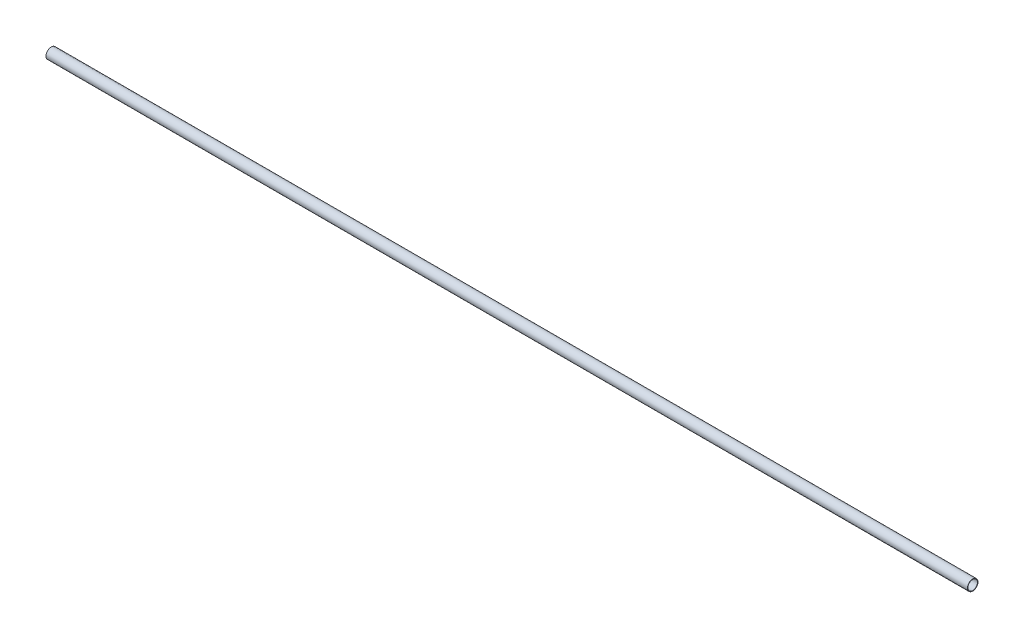
ISO-10303-21;
HEADER;
FILE_DESCRIPTION(('STEP AP214'),'2;1');
FILE_NAME('part.step','',(''),(''),'','','');
FILE_SCHEMA(('AUTOMOTIVE_DESIGN { 1 0 10303 214 1 1 1 1 }'));
ENDSEC;
DATA;
#1=APPLICATION_CONTEXT('core data for automotive mechanical design processes');
#2=APPLICATION_PROTOCOL_DEFINITION('international standard','automotive_design',2000,#1);
#3=PRODUCT_CONTEXT('',#1,'mechanical');
#4=PRODUCT('Part','Part','',(#3));
#5=PRODUCT_RELATED_PRODUCT_CATEGORY('part','',(#4));
#6=PRODUCT_DEFINITION_FORMATION('','',#4);
#7=PRODUCT_DEFINITION_CONTEXT('part definition',#1,'design');
#8=PRODUCT_DEFINITION('design','',#6,#7);
#9=PRODUCT_DEFINITION_SHAPE('','',#8);
#10=(LENGTH_UNIT() NAMED_UNIT(*) SI_UNIT(.MILLI.,.METRE.));
#11=(NAMED_UNIT(*) PLANE_ANGLE_UNIT() SI_UNIT($,.RADIAN.));
#12=(NAMED_UNIT(*) SI_UNIT($,.STERADIAN.) SOLID_ANGLE_UNIT());
#13=UNCERTAINTY_MEASURE_WITH_UNIT(LENGTH_MEASURE(1.E-05),#10,'distance_accuracy_value','');
#14=(GEOMETRIC_REPRESENTATION_CONTEXT(3) GLOBAL_UNCERTAINTY_ASSIGNED_CONTEXT((#13)) GLOBAL_UNIT_ASSIGNED_CONTEXT((#10,
#11,#12)) REPRESENTATION_CONTEXT('',''));
#15=CARTESIAN_POINT('',(0.,0.,0.));
#16=DIRECTION('',(0.,0.,1.));
#17=DIRECTION('',(1.,0.,0.));
#18=AXIS2_PLACEMENT_3D('',#15,#16,#17);
#19=CARTESIAN_POINT('',(1219.2,0.,0.));
#20=DIRECTION('',(-1.,0.,0.));
#21=DIRECTION('',(0.,0.,1.));
#22=AXIS2_PLACEMENT_3D('',#19,#20,#21);
#23=CYLINDRICAL_SURFACE('',#22,6.985);
#24=CARTESIAN_POINT('',(1219.2,0.,0.));
#25=DIRECTION('',(1.,0.,0.));
#26=DIRECTION('',(0.,0.,-1.));
#27=AXIS2_PLACEMENT_3D('',#24,#25,#26);
#28=CIRCLE('',#27,6.985);
#29=CARTESIAN_POINT('',(1219.2,0.,-6.985));
#30=VERTEX_POINT('',#29);
#31=EDGE_CURVE('E10',#30,#30,#28,.T.);
#32=ORIENTED_EDGE('',*,*,#31,.F.);
#33=EDGE_LOOP('',(#32));
#34=FACE_BOUND('',#33,.T.);
#35=CARTESIAN_POINT('',(0.,0.,0.));
#36=DIRECTION('',(1.,0.,0.));
#37=DIRECTION('',(0.,0.,-1.));
#38=AXIS2_PLACEMENT_3D('',#35,#36,#37);
#39=CIRCLE('',#38,6.985);
#40=CARTESIAN_POINT('',(0.,0.,-6.985));
#41=VERTEX_POINT('',#40);
#42=EDGE_CURVE('E33',#41,#41,#39,.T.);
#43=ORIENTED_EDGE('',*,*,#42,.T.);
#44=EDGE_LOOP('',(#43));
#45=FACE_BOUND('',#44,.T.);
#46=ADVANCED_FACE('F30',(#34,#45),#23,.T.);
#47=CARTESIAN_POINT('',(1219.2,0.,0.));
#48=DIRECTION('',(1.,0.,0.));
#49=DIRECTION('',(0.,0.,-1.));
#50=AXIS2_PLACEMENT_3D('',#47,#48,#49);
#51=PLANE('',#50);
#52=CARTESIAN_POINT('',(1219.2,0.,0.));
#53=DIRECTION('',(-1.,0.,0.));
#54=DIRECTION('',(0.,0.,1.));
#55=AXIS2_PLACEMENT_3D('',#52,#53,#54);
#56=CIRCLE('',#55,6.35);
#57=CARTESIAN_POINT('',(1219.2,0.,6.35));
#58=VERTEX_POINT('',#57);
#59=EDGE_CURVE('E40',#58,#58,#56,.T.);
#60=ORIENTED_EDGE('',*,*,#59,.T.);
#61=EDGE_LOOP('',(#60));
#62=FACE_BOUND('',#61,.T.);
#63=ORIENTED_EDGE('',*,*,#31,.T.);
#64=EDGE_LOOP('',(#63));
#65=FACE_BOUND('',#64,.T.);
#66=ADVANCED_FACE('F48',(#62,#65),#51,.T.);
#67=CARTESIAN_POINT('',(0.,0.,0.));
#68=DIRECTION('',(1.,0.,0.));
#69=DIRECTION('',(0.,0.,-1.));
#70=AXIS2_PLACEMENT_3D('',#67,#68,#69);
#71=PLANE('',#70);
#72=CARTESIAN_POINT('',(0.,0.,0.));
#73=DIRECTION('',(-1.,0.,0.));
#74=DIRECTION('',(0.,0.,1.));
#75=AXIS2_PLACEMENT_3D('',#72,#73,#74);
#76=CIRCLE('',#75,6.35);
#77=CARTESIAN_POINT('',(0.,0.,6.35));
#78=VERTEX_POINT('',#77);
#79=EDGE_CURVE('E42',#78,#78,#76,.T.);
#80=ORIENTED_EDGE('',*,*,#79,.F.);
#81=EDGE_LOOP('',(#80));
#82=FACE_BOUND('',#81,.T.);
#83=ORIENTED_EDGE('',*,*,#42,.F.);
#84=EDGE_LOOP('',(#83));
#85=FACE_BOUND('',#84,.T.);
#86=ADVANCED_FACE('F53',(#82,#85),#71,.F.);
#87=CARTESIAN_POINT('',(1219.2,0.,0.));
#88=DIRECTION('',(-1.,0.,0.));
#89=DIRECTION('',(0.,0.,1.));
#90=AXIS2_PLACEMENT_3D('',#87,#88,#89);
#91=CYLINDRICAL_SURFACE('',#90,6.35);
#92=ORIENTED_EDGE('',*,*,#59,.F.);
#93=EDGE_LOOP('',(#92));
#94=FACE_BOUND('',#93,.T.);
#95=ORIENTED_EDGE('',*,*,#79,.T.);
#96=EDGE_LOOP('',(#95));
#97=FACE_BOUND('',#96,.T.);
#98=ADVANCED_FACE('F50',(#94,#97),#91,.F.);
#99=CLOSED_SHELL('',(#46,#66,#86,#98));
#100=MANIFOLD_SOLID_BREP('B2',#99);
#101=ADVANCED_BREP_SHAPE_REPRESENTATION('',(#18,#100),#14);
#102=SHAPE_DEFINITION_REPRESENTATION(#9,#101);
ENDSEC;
END-ISO-10303-21;
